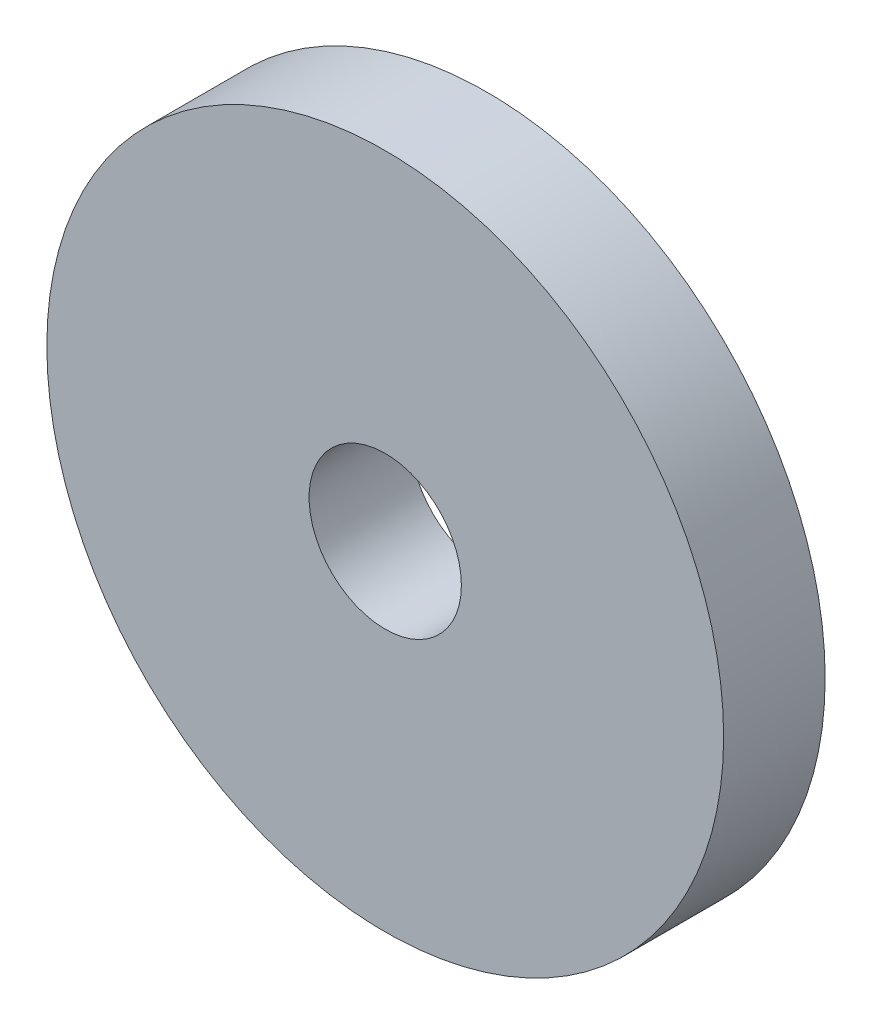
ISO-10303-21;
HEADER;
FILE_DESCRIPTION(('STEP AP214'),'2;1');
FILE_NAME('part.step','',(''),(''),'','','');
FILE_SCHEMA(('AUTOMOTIVE_DESIGN { 1 0 10303 214 1 1 1 1 }'));
ENDSEC;
DATA;
#1=APPLICATION_CONTEXT('core data for automotive mechanical design processes');
#2=APPLICATION_PROTOCOL_DEFINITION('international standard','automotive_design',2000,#1);
#3=PRODUCT_CONTEXT('',#1,'mechanical');
#4=PRODUCT('Part','Part','',(#3));
#5=PRODUCT_RELATED_PRODUCT_CATEGORY('part','',(#4));
#6=PRODUCT_DEFINITION_FORMATION('','',#4);
#7=PRODUCT_DEFINITION_CONTEXT('part definition',#1,'design');
#8=PRODUCT_DEFINITION('design','',#6,#7);
#9=PRODUCT_DEFINITION_SHAPE('','',#8);
#10=(LENGTH_UNIT() NAMED_UNIT(*) SI_UNIT(.MILLI.,.METRE.));
#11=(NAMED_UNIT(*) PLANE_ANGLE_UNIT() SI_UNIT($,.RADIAN.));
#12=(NAMED_UNIT(*) SI_UNIT($,.STERADIAN.) SOLID_ANGLE_UNIT());
#13=UNCERTAINTY_MEASURE_WITH_UNIT(LENGTH_MEASURE(1.E-05),#10,'distance_accuracy_value','');
#14=(GEOMETRIC_REPRESENTATION_CONTEXT(3) GLOBAL_UNCERTAINTY_ASSIGNED_CONTEXT((#13)) GLOBAL_UNIT_ASSIGNED_CONTEXT((#10,
#11,#12)) REPRESENTATION_CONTEXT('',''));
#15=CARTESIAN_POINT('',(0.,0.,0.));
#16=DIRECTION('',(0.,0.,1.));
#17=DIRECTION('',(1.,0.,0.));
#18=AXIS2_PLACEMENT_3D('',#15,#16,#17);
#19=CARTESIAN_POINT('',(0.,0.,3.));
#20=DIRECTION('',(0.,0.,1.));
#21=DIRECTION('',(1.,0.,0.));
#22=AXIS2_PLACEMENT_3D('',#19,#20,#21);
#23=PLANE('',#22);
#24=CARTESIAN_POINT('',(0.,0.,3.));
#25=DIRECTION('',(0.,0.,1.));
#26=DIRECTION('',(1.,0.,0.));
#27=AXIS2_PLACEMENT_3D('',#24,#25,#26);
#28=CIRCLE('',#27,10.);
#29=CARTESIAN_POINT('',(10.,0.,3.));
#30=VERTEX_POINT('',#29);
#31=EDGE_CURVE('E10',#30,#30,#28,.T.);
#32=ORIENTED_EDGE('',*,*,#31,.T.);
#33=EDGE_LOOP('',(#32));
#34=FACE_BOUND('',#33,.T.);
#35=CARTESIAN_POINT('',(0.,0.,3.));
#36=DIRECTION('',(0.,0.,1.));
#37=DIRECTION('',(1.,0.,0.));
#38=AXIS2_PLACEMENT_3D('',#35,#36,#37);
#39=CIRCLE('',#38,2.25);
#40=CARTESIAN_POINT('',(2.25,0.,3.));
#41=VERTEX_POINT('',#40);
#42=EDGE_CURVE('E42',#41,#41,#39,.T.);
#43=ORIENTED_EDGE('',*,*,#42,.F.);
#44=EDGE_LOOP('',(#43));
#45=FACE_BOUND('',#44,.T.);
#46=ADVANCED_FACE('F31',(#34,#45),#23,.T.);
#47=CARTESIAN_POINT('',(0.,0.,0.));
#48=DIRECTION('',(0.,0.,1.));
#49=DIRECTION('',(1.,0.,0.));
#50=AXIS2_PLACEMENT_3D('',#47,#48,#49);
#51=PLANE('',#50);
#52=CARTESIAN_POINT('',(0.,0.,0.));
#53=DIRECTION('',(0.,0.,1.));
#54=DIRECTION('',(1.,0.,0.));
#55=AXIS2_PLACEMENT_3D('',#52,#53,#54);
#56=CIRCLE('',#55,10.);
#57=CARTESIAN_POINT('',(10.,0.,0.));
#58=VERTEX_POINT('',#57);
#59=EDGE_CURVE('E35',#58,#58,#56,.T.);
#60=ORIENTED_EDGE('',*,*,#59,.F.);
#61=EDGE_LOOP('',(#60));
#62=FACE_BOUND('',#61,.T.);
#63=CARTESIAN_POINT('',(0.,0.,0.));
#64=DIRECTION('',(0.,0.,1.));
#65=DIRECTION('',(1.,0.,0.));
#66=AXIS2_PLACEMENT_3D('',#63,#64,#65);
#67=CIRCLE('',#66,2.25);
#68=CARTESIAN_POINT('',(2.25,0.,0.));
#69=VERTEX_POINT('',#68);
#70=EDGE_CURVE('E44',#69,#69,#67,.T.);
#71=ORIENTED_EDGE('',*,*,#70,.T.);
#72=EDGE_LOOP('',(#71));
#73=FACE_BOUND('',#72,.T.);
#74=ADVANCED_FACE('F54',(#62,#73),#51,.F.);
#75=CARTESIAN_POINT('',(0.,0.,3.));
#76=DIRECTION('',(0.,0.,-1.));
#77=DIRECTION('',(-1.,0.,0.));
#78=AXIS2_PLACEMENT_3D('',#75,#76,#77);
#79=CYLINDRICAL_SURFACE('',#78,10.);
#80=ORIENTED_EDGE('',*,*,#31,.F.);
#81=EDGE_LOOP('',(#80));
#82=FACE_BOUND('',#81,.T.);
#83=ORIENTED_EDGE('',*,*,#59,.T.);
#84=EDGE_LOOP('',(#83));
#85=FACE_BOUND('',#84,.T.);
#86=ADVANCED_FACE('F33',(#82,#85),#79,.T.);
#87=CARTESIAN_POINT('',(0.,0.,3.));
#88=DIRECTION('',(0.,0.,-1.));
#89=DIRECTION('',(-1.,0.,0.));
#90=AXIS2_PLACEMENT_3D('',#87,#88,#89);
#91=CYLINDRICAL_SURFACE('',#90,2.25);
#92=ORIENTED_EDGE('',*,*,#42,.T.);
#93=EDGE_LOOP('',(#92));
#94=FACE_BOUND('',#93,.T.);
#95=ORIENTED_EDGE('',*,*,#70,.F.);
#96=EDGE_LOOP('',(#95));
#97=FACE_BOUND('',#96,.T.);
#98=ADVANCED_FACE('F50',(#94,#97),#91,.F.);
#99=CLOSED_SHELL('',(#46,#74,#86,#98));
#100=MANIFOLD_SOLID_BREP('B2',#99);
#101=ADVANCED_BREP_SHAPE_REPRESENTATION('',(#18,#100),#14);
#102=SHAPE_DEFINITION_REPRESENTATION(#9,#101);
ENDSEC;
END-ISO-10303-21;
